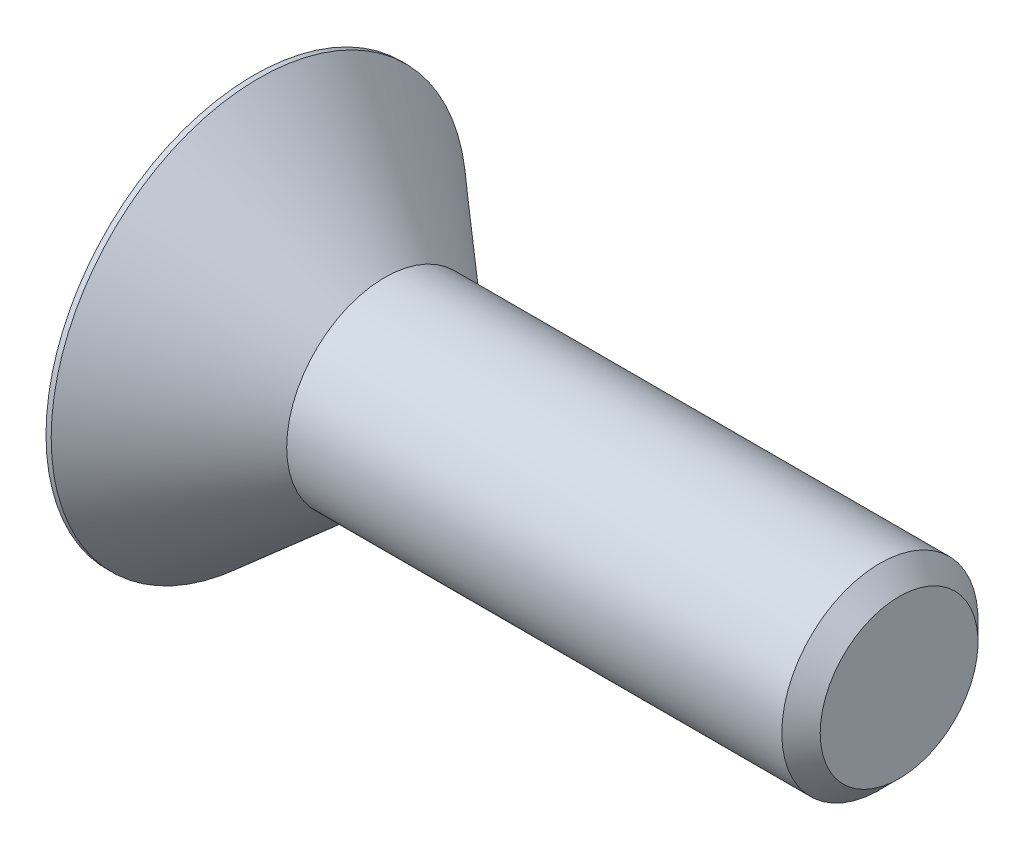
ISO-10303-21;
HEADER;
FILE_DESCRIPTION(('STEP AP214'),'2;1');
FILE_NAME('part.step','',(''),(''),'','','');
FILE_SCHEMA(('AUTOMOTIVE_DESIGN { 1 0 10303 214 1 1 1 1 }'));
ENDSEC;
DATA;
#1=APPLICATION_CONTEXT('core data for automotive mechanical design processes');
#2=APPLICATION_PROTOCOL_DEFINITION('international standard','automotive_design',2000,#1);
#3=PRODUCT_CONTEXT('',#1,'mechanical');
#4=PRODUCT('Part','Part','',(#3));
#5=PRODUCT_RELATED_PRODUCT_CATEGORY('part','',(#4));
#6=PRODUCT_DEFINITION_FORMATION('','',#4);
#7=PRODUCT_DEFINITION_CONTEXT('part definition',#1,'design');
#8=PRODUCT_DEFINITION('design','',#6,#7);
#9=PRODUCT_DEFINITION_SHAPE('','',#8);
#10=(LENGTH_UNIT() NAMED_UNIT(*) SI_UNIT(.MILLI.,.METRE.));
#11=(NAMED_UNIT(*) PLANE_ANGLE_UNIT() SI_UNIT($,.RADIAN.));
#12=(NAMED_UNIT(*) SI_UNIT($,.STERADIAN.) SOLID_ANGLE_UNIT());
#13=UNCERTAINTY_MEASURE_WITH_UNIT(LENGTH_MEASURE(1.E-05),#10,'distance_accuracy_value','');
#14=(GEOMETRIC_REPRESENTATION_CONTEXT(3) GLOBAL_UNCERTAINTY_ASSIGNED_CONTEXT((#13)) GLOBAL_UNIT_ASSIGNED_CONTEXT((#10,
#11,#12)) REPRESENTATION_CONTEXT('',''));
#15=CARTESIAN_POINT('',(0.,0.,0.));
#16=DIRECTION('',(0.,0.,1.));
#17=DIRECTION('',(1.,0.,0.));
#18=AXIS2_PLACEMENT_3D('',#15,#16,#17);
#19=CARTESIAN_POINT('',(2.20980000000282,0.,0.));
#20=DIRECTION('',(-1.,0.,0.));
#21=DIRECTION('',(0.,0.,1.));
#22=AXIS2_PLACEMENT_3D('',#19,#20,#21);
#23=CONICAL_SURFACE('',#22,1.58749999997099,1.04719755118793);
#24=CARTESIAN_POINT('',(3.12634355233854,0.,-5.6843418860808E-11));
#25=VERTEX_POINT('',#24);
#26=VERTEX_LOOP('',#25);
#27=FACE_BOUND('',#26,.T.);
#28=CARTESIAN_POINT('',(2.20980000000282,0.,0.));
#29=DIRECTION('',(-1.,0.,0.));
#30=DIRECTION('',(0.,0.,1.));
#31=AXIS2_PLACEMENT_3D('',#28,#29,#30);
#32=CIRCLE('',#31,1.58749999997099);
#33=CARTESIAN_POINT('',(2.2098000000014,0.,-1.58749999998549));
#34=VERTEX_POINT('',#33);
#35=CARTESIAN_POINT('',(2.2098000000014,1.37481532849523,-0.793749999992743));
#36=VERTEX_POINT('',#35);
#37=EDGE_CURVE('E20',#34,#36,#32,.F.);
#38=ORIENTED_EDGE('',*,*,#37,.F.);
#39=CARTESIAN_POINT('',(2.20980000000282,0.,0.));
#40=DIRECTION('',(-1.,0.,0.));
#41=DIRECTION('',(0.,0.,1.));
#42=AXIS2_PLACEMENT_3D('',#39,#40,#41);
#43=CIRCLE('',#42,1.58749999997099);
#44=CARTESIAN_POINT('',(2.2098000000014,-1.37481532849523,-0.793749999992754));
#45=VERTEX_POINT('',#44);
#46=EDGE_CURVE('E88',#45,#34,#43,.F.);
#47=ORIENTED_EDGE('',*,*,#46,.F.);
#48=CARTESIAN_POINT('',(2.20980000000282,0.,0.));
#49=DIRECTION('',(-1.,0.,0.));
#50=DIRECTION('',(0.,0.,1.));
#51=AXIS2_PLACEMENT_3D('',#48,#49,#50);
#52=CIRCLE('',#51,1.58749999997099);
#53=CARTESIAN_POINT('',(2.2098000000014,-1.37481532849523,0.793749999992755));
#54=VERTEX_POINT('',#53);
#55=EDGE_CURVE('E106',#54,#45,#52,.F.);
#56=ORIENTED_EDGE('',*,*,#55,.F.);
#57=CARTESIAN_POINT('',(2.20980000000282,0.,0.));
#58=DIRECTION('',(-1.,0.,0.));
#59=DIRECTION('',(0.,0.,1.));
#60=AXIS2_PLACEMENT_3D('',#57,#58,#59);
#61=CIRCLE('',#60,1.58749999997099);
#62=CARTESIAN_POINT('',(2.2098000000014,0.,1.5874999999855));
#63=VERTEX_POINT('',#62);
#64=EDGE_CURVE('E105',#63,#54,#61,.F.);
#65=ORIENTED_EDGE('',*,*,#64,.F.);
#66=CARTESIAN_POINT('',(2.20980000000282,0.,0.));
#67=DIRECTION('',(-1.,0.,0.));
#68=DIRECTION('',(0.,0.,1.));
#69=AXIS2_PLACEMENT_3D('',#66,#67,#68);
#70=CIRCLE('',#69,1.58749999997099);
#71=CARTESIAN_POINT('',(2.2098000000014,1.37481532849524,0.793749999992742));
#72=VERTEX_POINT('',#71);
#73=EDGE_CURVE('E168',#72,#63,#70,.F.);
#74=ORIENTED_EDGE('',*,*,#73,.F.);
#75=CARTESIAN_POINT('',(2.20980000000282,0.,0.));
#76=DIRECTION('',(-1.,0.,0.));
#77=DIRECTION('',(0.,0.,1.));
#78=AXIS2_PLACEMENT_3D('',#75,#76,#77);
#79=CIRCLE('',#78,1.58749999997099);
#80=EDGE_CURVE('E91',#36,#72,#79,.F.);
#81=ORIENTED_EDGE('',*,*,#80,.F.);
#82=EDGE_LOOP('',(#38,#47,#56,#65,#74,#81));
#83=FACE_BOUND('',#82,.T.);
#84=ADVANCED_FACE('F17',(#27,#83),#23,.F.);
#85=CARTESIAN_POINT('',(2.20979999999998,-1.83308710467707,0.));
#86=DIRECTION('',(-1.,0.,0.));
#87=DIRECTION('',(0.,0.,1.));
#88=AXIS2_PLACEMENT_3D('',#85,#86,#87);
#89=PLANE('',#88);
#90=DIRECTION('',(0.,-0.500000000000001,0.866025403784438));
#91=VECTOR('',#90,1.);
#92=CARTESIAN_POINT('',(2.20979999999998,-1.83308710467706,0.));
#93=LINE('',#92,#91);
#94=CARTESIAN_POINT('',(2.20979999999998,-1.83308710467706,0.));
#95=VERTEX_POINT('',#94);
#96=EDGE_CURVE('E129',#95,#45,#93,.F.);
#97=ORIENTED_EDGE('',*,*,#96,.F.);
#98=DIRECTION('',(0.,0.500000000000002,0.866025403784438));
#99=VECTOR('',#98,1.);
#100=CARTESIAN_POINT('',(2.20979999999998,-0.916543552338528,1.58750000000001));
#101=LINE('',#100,#99);
#102=EDGE_CURVE('E145',#54,#95,#101,.F.);
#103=ORIENTED_EDGE('',*,*,#102,.F.);
#104=ORIENTED_EDGE('',*,*,#55,.T.);
#105=EDGE_LOOP('',(#97,#103,#104));
#106=FACE_BOUND('',#105,.T.);
#107=ADVANCED_FACE('F264',(#106),#89,.T.);
#108=CARTESIAN_POINT('',(2.20979999999998,-1.83308710467707,0.));
#109=DIRECTION('',(-1.,0.,0.));
#110=DIRECTION('',(0.,0.,1.));
#111=AXIS2_PLACEMENT_3D('',#108,#109,#110);
#112=PLANE('',#111);
#113=DIRECTION('',(0.,-1.,0.));
#114=VECTOR('',#113,1.);
#115=CARTESIAN_POINT('',(2.20979999999998,-0.916543552338531,-1.58749999999999));
#116=LINE('',#115,#114);
#117=CARTESIAN_POINT('',(2.20979999999998,-0.916543552338532,-1.58749999999999));
#118=VERTEX_POINT('',#117);
#119=EDGE_CURVE('E101',#118,#34,#116,.F.);
#120=ORIENTED_EDGE('',*,*,#119,.F.);
#121=DIRECTION('',(0.,-0.500000000000001,0.866025403784438));
#122=VECTOR('',#121,1.);
#123=CARTESIAN_POINT('',(2.20979999999998,-1.83308710467706,0.));
#124=LINE('',#123,#122);
#125=EDGE_CURVE('E103',#45,#118,#124,.F.);
#126=ORIENTED_EDGE('',*,*,#125,.F.);
#127=ORIENTED_EDGE('',*,*,#46,.T.);
#128=EDGE_LOOP('',(#120,#126,#127));
#129=FACE_BOUND('',#128,.T.);
#130=ADVANCED_FACE('F99',(#129),#112,.T.);
#131=CARTESIAN_POINT('',(2.20979999999998,-1.83308710467707,0.));
#132=DIRECTION('',(-1.,0.,0.));
#133=DIRECTION('',(0.,0.,1.));
#134=AXIS2_PLACEMENT_3D('',#131,#132,#133);
#135=PLANE('',#134);
#136=DIRECTION('',(0.,-0.5,-0.866025403784439));
#137=VECTOR('',#136,1.);
#138=CARTESIAN_POINT('',(2.20979999999998,0.916543552338531,-1.58749999999999));
#139=LINE('',#138,#137);
#140=CARTESIAN_POINT('',(2.20979999999998,0.916543552338531,-1.58749999999999));
#141=VERTEX_POINT('',#140);
#142=EDGE_CURVE('E110',#141,#36,#139,.F.);
#143=ORIENTED_EDGE('',*,*,#142,.F.);
#144=DIRECTION('',(0.,-1.,0.));
#145=VECTOR('',#144,1.);
#146=CARTESIAN_POINT('',(2.20979999999998,-0.916543552338531,-1.58749999999999));
#147=LINE('',#146,#145);
#148=EDGE_CURVE('E108',#34,#141,#147,.F.);
#149=ORIENTED_EDGE('',*,*,#148,.F.);
#150=ORIENTED_EDGE('',*,*,#37,.T.);
#151=EDGE_LOOP('',(#143,#149,#150));
#152=FACE_BOUND('',#151,.T.);
#153=ADVANCED_FACE('F109',(#152),#135,.T.);
#154=CARTESIAN_POINT('',(2.20979999999998,-1.83308710467707,0.));
#155=DIRECTION('',(-1.,0.,0.));
#156=DIRECTION('',(0.,0.,1.));
#157=AXIS2_PLACEMENT_3D('',#154,#155,#156);
#158=PLANE('',#157);
#159=DIRECTION('',(0.,0.499999999999999,-0.866025403784439));
#160=VECTOR('',#159,1.);
#161=CARTESIAN_POINT('',(2.20979999999998,1.83308710467706,0.));
#162=LINE('',#161,#160);
#163=CARTESIAN_POINT('',(2.20979999999998,1.83308710467706,0.));
#164=VERTEX_POINT('',#163);
#165=EDGE_CURVE('E174',#164,#72,#162,.F.);
#166=ORIENTED_EDGE('',*,*,#165,.F.);
#167=DIRECTION('',(0.,-0.5,-0.866025403784439));
#168=VECTOR('',#167,1.);
#169=CARTESIAN_POINT('',(2.20979999999998,0.916543552338531,-1.58749999999999));
#170=LINE('',#169,#168);
#171=EDGE_CURVE('E176',#36,#164,#170,.F.);
#172=ORIENTED_EDGE('',*,*,#171,.F.);
#173=ORIENTED_EDGE('',*,*,#80,.T.);
#174=EDGE_LOOP('',(#166,#172,#173));
#175=FACE_BOUND('',#174,.T.);
#176=ADVANCED_FACE('F173',(#175),#158,.T.);
#177=CARTESIAN_POINT('',(2.20979999999998,-1.83308710467707,0.));
#178=DIRECTION('',(-1.,0.,0.));
#179=DIRECTION('',(0.,0.,1.));
#180=AXIS2_PLACEMENT_3D('',#177,#178,#179);
#181=PLANE('',#180);
#182=DIRECTION('',(0.,1.,0.));
#183=VECTOR('',#182,1.);
#184=CARTESIAN_POINT('',(2.20979999999998,0.916543552338531,1.58750000000001));
#185=LINE('',#184,#183);
#186=CARTESIAN_POINT('',(2.20979999999998,0.91654355233853,1.58750000000001));
#187=VERTEX_POINT('',#186);
#188=EDGE_CURVE('E187',#187,#63,#185,.F.);
#189=ORIENTED_EDGE('',*,*,#188,.F.);
#190=DIRECTION('',(0.,0.499999999999999,-0.866025403784439));
#191=VECTOR('',#190,1.);
#192=CARTESIAN_POINT('',(2.20979999999998,1.83308710467706,0.));
#193=LINE('',#192,#191);
#194=EDGE_CURVE('E179',#72,#187,#193,.F.);
#195=ORIENTED_EDGE('',*,*,#194,.F.);
#196=ORIENTED_EDGE('',*,*,#73,.T.);
#197=EDGE_LOOP('',(#189,#195,#196));
#198=FACE_BOUND('',#197,.T.);
#199=ADVANCED_FACE('F184',(#198),#181,.T.);
#200=CARTESIAN_POINT('',(2.20979999999998,-1.83308710467707,0.));
#201=DIRECTION('',(-1.,0.,0.));
#202=DIRECTION('',(0.,0.,1.));
#203=AXIS2_PLACEMENT_3D('',#200,#201,#202);
#204=PLANE('',#203);
#205=DIRECTION('',(0.,0.500000000000002,0.866025403784438));
#206=VECTOR('',#205,1.);
#207=CARTESIAN_POINT('',(2.20979999999998,-0.916543552338528,1.58750000000001));
#208=LINE('',#207,#206);
#209=CARTESIAN_POINT('',(2.20979999999998,-0.916543552338528,1.58750000000001));
#210=VERTEX_POINT('',#209);
#211=EDGE_CURVE('E149',#210,#54,#208,.F.);
#212=ORIENTED_EDGE('',*,*,#211,.F.);
#213=DIRECTION('',(0.,1.,0.));
#214=VECTOR('',#213,1.);
#215=CARTESIAN_POINT('',(2.20979999999998,0.916543552338531,1.58750000000001));
#216=LINE('',#215,#214);
#217=EDGE_CURVE('E193',#63,#210,#216,.F.);
#218=ORIENTED_EDGE('',*,*,#217,.F.);
#219=ORIENTED_EDGE('',*,*,#64,.T.);
#220=EDGE_LOOP('',(#212,#218,#219));
#221=FACE_BOUND('',#220,.T.);
#222=ADVANCED_FACE('F194',(#221),#204,.T.);
#223=CARTESIAN_POINT('',(2.20979999999998,-0.916543552338528,1.58750000000001));
#224=DIRECTION('',(0.,0.866025403784438,-0.500000000000002));
#225=DIRECTION('',(0.,0.500000000000002,0.866025403784438));
#226=AXIS2_PLACEMENT_3D('',#223,#224,#225);
#227=PLANE('',#226);
#228=ORIENTED_EDGE('',*,*,#102,.T.);
#229=DIRECTION('',(1.,0.,0.));
#230=VECTOR('',#229,1.);
#231=CARTESIAN_POINT('',(2.20979999999998,-1.83308710467706,0.));
#232=LINE('',#231,#230);
#233=CARTESIAN_POINT('',(0.,-1.83308710467706,0.));
#234=VERTEX_POINT('',#233);
#235=EDGE_CURVE('E140',#234,#95,#232,.T.);
#236=ORIENTED_EDGE('',*,*,#235,.F.);
#237=DIRECTION('',(0.,-0.5,-0.866025403784438));
#238=VECTOR('',#237,1.);
#239=CARTESIAN_POINT('',(0.,-0.916543552338528,1.58750000000001));
#240=LINE('',#239,#238);
#241=CARTESIAN_POINT('',(0.,-0.916543552338528,1.58750000000001));
#242=VERTEX_POINT('',#241);
#243=EDGE_CURVE('E136',#242,#234,#240,.T.);
#244=ORIENTED_EDGE('',*,*,#243,.F.);
#245=DIRECTION('',(1.,0.,0.));
#246=VECTOR('',#245,1.);
#247=CARTESIAN_POINT('',(2.20979999999998,-0.916543552338528,1.58750000000001));
#248=LINE('',#247,#246);
#249=EDGE_CURVE('E154',#210,#242,#248,.F.);
#250=ORIENTED_EDGE('',*,*,#249,.F.);
#251=ORIENTED_EDGE('',*,*,#211,.T.);
#252=EDGE_LOOP('',(#228,#236,#244,#250,#251));
#253=FACE_BOUND('',#252,.T.);
#254=ADVANCED_FACE('F259',(#253),#227,.T.);
#255=CARTESIAN_POINT('',(2.20979999999998,-1.83308710467706,0.));
#256=DIRECTION('',(0.,0.866025403784438,0.500000000000001));
#257=DIRECTION('',(0.,-0.500000000000001,0.866025403784438));
#258=AXIS2_PLACEMENT_3D('',#255,#256,#257);
#259=PLANE('',#258);
#260=ORIENTED_EDGE('',*,*,#125,.T.);
#261=DIRECTION('',(1.,0.,0.));
#262=VECTOR('',#261,1.);
#263=CARTESIAN_POINT('',(2.20979999999998,-0.916543552338531,-1.58749999999999));
#264=LINE('',#263,#262);
#265=CARTESIAN_POINT('',(0.,-0.916543552338532,-1.58749999999999));
#266=VERTEX_POINT('',#265);
#267=EDGE_CURVE('E117',#266,#118,#264,.T.);
#268=ORIENTED_EDGE('',*,*,#267,.F.);
#269=DIRECTION('',(0.,0.500000000000002,-0.866025403784437));
#270=VECTOR('',#269,1.);
#271=CARTESIAN_POINT('',(0.,-1.83308710467706,0.));
#272=LINE('',#271,#270);
#273=EDGE_CURVE('E132',#234,#266,#272,.T.);
#274=ORIENTED_EDGE('',*,*,#273,.F.);
#275=ORIENTED_EDGE('',*,*,#235,.T.);
#276=ORIENTED_EDGE('',*,*,#96,.T.);
#277=EDGE_LOOP('',(#260,#268,#274,#275,#276));
#278=FACE_BOUND('',#277,.T.);
#279=ADVANCED_FACE('F262',(#278),#259,.T.);
#280=CARTESIAN_POINT('',(2.20979999999998,-0.916543552338531,-1.58749999999999));
#281=DIRECTION('',(0.,0.,1.));
#282=DIRECTION('',(0.,-1.,0.));
#283=AXIS2_PLACEMENT_3D('',#280,#281,#282);
#284=PLANE('',#283);
#285=ORIENTED_EDGE('',*,*,#148,.T.);
#286=DIRECTION('',(1.,0.,0.));
#287=VECTOR('',#286,1.);
#288=CARTESIAN_POINT('',(2.20979999999998,0.916543552338531,-1.58749999999999));
#289=LINE('',#288,#287);
#290=CARTESIAN_POINT('',(0.,0.916543552338531,-1.58749999999999));
#291=VERTEX_POINT('',#290);
#292=EDGE_CURVE('E113',#291,#141,#289,.T.);
#293=ORIENTED_EDGE('',*,*,#292,.F.);
#294=DIRECTION('',(0.,1.,0.));
#295=VECTOR('',#294,1.);
#296=CARTESIAN_POINT('',(0.,0.,-1.58749999999999));
#297=LINE('',#296,#295);
#298=EDGE_CURVE('E135',#266,#291,#297,.T.);
#299=ORIENTED_EDGE('',*,*,#298,.F.);
#300=ORIENTED_EDGE('',*,*,#267,.T.);
#301=ORIENTED_EDGE('',*,*,#119,.T.);
#302=EDGE_LOOP('',(#285,#293,#299,#300,#301));
#303=FACE_BOUND('',#302,.T.);
#304=ADVANCED_FACE('F115',(#303),#284,.T.);
#305=CARTESIAN_POINT('',(2.20979999999998,0.916543552338531,-1.58749999999999));
#306=DIRECTION('',(0.,-0.866025403784439,0.5));
#307=DIRECTION('',(0.,-0.5,-0.866025403784439));
#308=AXIS2_PLACEMENT_3D('',#305,#306,#307);
#309=PLANE('',#308);
#310=ORIENTED_EDGE('',*,*,#171,.T.);
#311=DIRECTION('',(1.,0.,0.));
#312=VECTOR('',#311,1.);
#313=CARTESIAN_POINT('',(2.20979999999998,1.83308710467706,0.));
#314=LINE('',#313,#312);
#315=CARTESIAN_POINT('',(0.,1.83308710467706,0.));
#316=VERTEX_POINT('',#315);
#317=EDGE_CURVE('E181',#316,#164,#314,.T.);
#318=ORIENTED_EDGE('',*,*,#317,.F.);
#319=DIRECTION('',(0.,0.500000000000001,0.866025403784438));
#320=VECTOR('',#319,1.);
#321=CARTESIAN_POINT('',(0.,0.916543552338531,-1.58749999999999));
#322=LINE('',#321,#320);
#323=EDGE_CURVE('E227',#291,#316,#322,.T.);
#324=ORIENTED_EDGE('',*,*,#323,.F.);
#325=ORIENTED_EDGE('',*,*,#292,.T.);
#326=ORIENTED_EDGE('',*,*,#142,.T.);
#327=EDGE_LOOP('',(#310,#318,#324,#325,#326));
#328=FACE_BOUND('',#327,.T.);
#329=ADVANCED_FACE('F256',(#328),#309,.T.);
#330=CARTESIAN_POINT('',(2.20979999999998,1.83308710467706,0.));
#331=DIRECTION('',(0.,-0.866025403784439,-0.499999999999999));
#332=DIRECTION('',(0.,0.499999999999999,-0.866025403784439));
#333=AXIS2_PLACEMENT_3D('',#330,#331,#332);
#334=PLANE('',#333);
#335=ORIENTED_EDGE('',*,*,#194,.T.);
#336=DIRECTION('',(1.,0.,0.));
#337=VECTOR('',#336,1.);
#338=CARTESIAN_POINT('',(2.20979999999998,0.916543552338531,1.58750000000001));
#339=LINE('',#338,#337);
#340=CARTESIAN_POINT('',(0.,0.916543552338531,1.58750000000001));
#341=VERTEX_POINT('',#340);
#342=EDGE_CURVE('E35',#341,#187,#339,.T.);
#343=ORIENTED_EDGE('',*,*,#342,.F.);
#344=DIRECTION('',(0.,-0.499999999999997,0.86602540378444));
#345=VECTOR('',#344,1.);
#346=CARTESIAN_POINT('',(0.,1.83308710467706,0.));
#347=LINE('',#346,#345);
#348=EDGE_CURVE('E222',#316,#341,#347,.T.);
#349=ORIENTED_EDGE('',*,*,#348,.F.);
#350=ORIENTED_EDGE('',*,*,#317,.T.);
#351=ORIENTED_EDGE('',*,*,#165,.T.);
#352=EDGE_LOOP('',(#335,#343,#349,#350,#351));
#353=FACE_BOUND('',#352,.T.);
#354=ADVANCED_FACE('F178',(#353),#334,.T.);
#355=CARTESIAN_POINT('',(2.20979999999998,0.916543552338531,1.58750000000001));
#356=DIRECTION('',(0.,0.,-1.));
#357=DIRECTION('',(0.,1.,0.));
#358=AXIS2_PLACEMENT_3D('',#355,#356,#357);
#359=PLANE('',#358);
#360=ORIENTED_EDGE('',*,*,#217,.T.);
#361=ORIENTED_EDGE('',*,*,#249,.T.);
#362=DIRECTION('',(0.,1.,0.));
#363=VECTOR('',#362,1.);
#364=CARTESIAN_POINT('',(0.,0.,1.58750000000001));
#365=LINE('',#364,#363);
#366=EDGE_CURVE('E164',#341,#242,#365,.F.);
#367=ORIENTED_EDGE('',*,*,#366,.F.);
#368=ORIENTED_EDGE('',*,*,#342,.T.);
#369=ORIENTED_EDGE('',*,*,#188,.T.);
#370=EDGE_LOOP('',(#360,#361,#367,#368,#369));
#371=FACE_BOUND('',#370,.T.);
#372=ADVANCED_FACE('F200',(#371),#359,.T.);
#373=CARTESIAN_POINT('',(0.,0.,0.));
#374=DIRECTION('',(-1.,0.,0.));
#375=DIRECTION('',(0.,0.,1.));
#376=AXIS2_PLACEMENT_3D('',#373,#374,#375);
#377=PLANE('',#376);
#378=ORIENTED_EDGE('',*,*,#348,.T.);
#379=ORIENTED_EDGE('',*,*,#366,.T.);
#380=ORIENTED_EDGE('',*,*,#243,.T.);
#381=ORIENTED_EDGE('',*,*,#273,.T.);
#382=ORIENTED_EDGE('',*,*,#298,.T.);
#383=ORIENTED_EDGE('',*,*,#323,.T.);
#384=EDGE_LOOP('',(#378,#379,#380,#381,#382,#383));
#385=FACE_BOUND('',#384,.T.);
#386=CARTESIAN_POINT('',(0.,0.,0.));
#387=DIRECTION('',(-1.,0.,0.));
#388=DIRECTION('',(0.,0.,1.));
#389=AXIS2_PLACEMENT_3D('',#386,#387,#388);
#390=CIRCLE('',#389,5.10667);
#391=CARTESIAN_POINT('',(0.,0.,5.10667));
#392=VERTEX_POINT('',#391);
#393=EDGE_CURVE('E161',#392,#392,#390,.F.);
#394=ORIENTED_EDGE('',*,*,#393,.F.);
#395=EDGE_LOOP('',(#394));
#396=FACE_BOUND('',#395,.T.);
#397=ADVANCED_FACE('F251',(#385,#396),#377,.T.);
#398=CARTESIAN_POINT('',(15.875,1.94056,0.));
#399=DIRECTION('',(1.,0.,0.));
#400=DIRECTION('',(0.,0.,-1.));
#401=AXIS2_PLACEMENT_3D('',#398,#399,#400);
#402=PLANE('',#401);
#403=CARTESIAN_POINT('',(15.8750000000509,0.,0.));
#404=DIRECTION('',(-1.,0.,0.));
#405=DIRECTION('',(0.,0.,1.));
#406=AXIS2_PLACEMENT_3D('',#403,#404,#405);
#407=CIRCLE('',#406,1.94055999992315);
#408=CARTESIAN_POINT('',(15.8750000000509,0.,1.94055999992315));
#409=VERTEX_POINT('',#408);
#410=EDGE_CURVE('E157',#409,#409,#407,.T.);
#411=ORIENTED_EDGE('',*,*,#410,.F.);
#412=EDGE_LOOP('',(#411));
#413=FACE_BOUND('',#412,.T.);
#414=ADVANCED_FACE('F292',(#413),#402,.T.);
#415=CARTESIAN_POINT('',(0.,0.,0.));
#416=DIRECTION('',(-1.,0.,0.));
#417=DIRECTION('',(0.,0.,1.));
#418=AXIS2_PLACEMENT_3D('',#415,#416,#417);
#419=CYLINDRICAL_SURFACE('',#418,5.10667);
#420=ORIENTED_EDGE('',*,*,#393,.T.);
#421=EDGE_LOOP('',(#420));
#422=FACE_BOUND('',#421,.T.);
#423=CARTESIAN_POINT('',(0.12700000007726,0.,0.));
#424=DIRECTION('',(-1.,0.,0.));
#425=DIRECTION('',(0.,0.,1.));
#426=AXIS2_PLACEMENT_3D('',#423,#424,#425);
#427=CIRCLE('',#426,5.10666999997511);
#428=CARTESIAN_POINT('',(0.12700000007726,0.,5.10666999997511));
#429=VERTEX_POINT('',#428);
#430=EDGE_CURVE('E160',#429,#429,#427,.F.);
#431=ORIENTED_EDGE('',*,*,#430,.F.);
#432=EDGE_LOOP('',(#431));
#433=FACE_BOUND('',#432,.T.);
#434=ADVANCED_FACE('F288',(#422,#433),#419,.T.);
#435=CARTESIAN_POINT('',(15.4025600000409,0.,0.));
#436=DIRECTION('',(-1.,0.,0.));
#437=DIRECTION('',(0.,0.,1.));
#438=AXIS2_PLACEMENT_3D('',#435,#436,#437);
#439=CONICAL_SURFACE('',#438,2.41299999993316,0.785398163397448);
#440=CARTESIAN_POINT('',(15.40256,0.,0.));
#441=DIRECTION('',(-1.,0.,0.));
#442=DIRECTION('',(0.,0.,1.));
#443=AXIS2_PLACEMENT_3D('',#440,#441,#442);
#444=CIRCLE('',#443,2.413);
#445=CARTESIAN_POINT('',(15.40256,0.,2.413));
#446=VERTEX_POINT('',#445);
#447=EDGE_CURVE('E26',#446,#446,#444,.T.);
#448=ORIENTED_EDGE('',*,*,#447,.F.);
#449=EDGE_LOOP('',(#448));
#450=FACE_BOUND('',#449,.T.);
#451=ORIENTED_EDGE('',*,*,#410,.T.);
#452=EDGE_LOOP('',(#451));
#453=FACE_BOUND('',#452,.T.);
#454=ADVANCED_FACE('F281',(#450,#453),#439,.T.);
#455=CARTESIAN_POINT('',(0.12700000024779,0.,0.));
#456=DIRECTION('',(-1.,0.,0.));
#457=DIRECTION('',(0.,0.,1.));
#458=AXIS2_PLACEMENT_3D('',#455,#456,#457);
#459=CONICAL_SURFACE('',#458,5.10666999986142,0.715584993323263);
#460=ORIENTED_EDGE('',*,*,#430,.T.);
#461=EDGE_LOOP('',(#460));
#462=FACE_BOUND('',#461,.T.);
#463=CARTESIAN_POINT('',(3.22571286747902,0.,0.));
#464=DIRECTION('',(-1.,0.,0.));
#465=DIRECTION('',(0.,0.,1.));
#466=AXIS2_PLACEMENT_3D('',#463,#464,#465);
#467=CIRCLE('',#466,2.413);
#468=CARTESIAN_POINT('',(3.22571286747902,0.,2.413));
#469=VERTEX_POINT('',#468);
#470=EDGE_CURVE('E11',#469,#469,#467,.F.);
#471=ORIENTED_EDGE('',*,*,#470,.F.);
#472=EDGE_LOOP('',(#471));
#473=FACE_BOUND('',#472,.T.);
#474=ADVANCED_FACE('F275',(#462,#473),#459,.T.);
#475=CARTESIAN_POINT('',(0.,0.,0.));
#476=DIRECTION('',(-1.,0.,0.));
#477=DIRECTION('',(0.,0.,1.));
#478=AXIS2_PLACEMENT_3D('',#475,#476,#477);
#479=CYLINDRICAL_SURFACE('',#478,2.413);
#480=ORIENTED_EDGE('',*,*,#470,.T.);
#481=EDGE_LOOP('',(#480));
#482=FACE_BOUND('',#481,.T.);
#483=ORIENTED_EDGE('',*,*,#447,.T.);
#484=EDGE_LOOP('',(#483));
#485=FACE_BOUND('',#484,.T.);
#486=ADVANCED_FACE('F273',(#482,#485),#479,.T.);
#487=CLOSED_SHELL('',(#84,#107,#130,#153,#176,#199,#222,#254,#279,#304,#329,#354,#372,#397,#414,
#434,#454,#474,#486));
#488=MANIFOLD_SOLID_BREP('B1',#487);
#489=ADVANCED_BREP_SHAPE_REPRESENTATION('',(#18,#488),#14);
#490=SHAPE_DEFINITION_REPRESENTATION(#9,#489);
ENDSEC;
END-ISO-10303-21;
